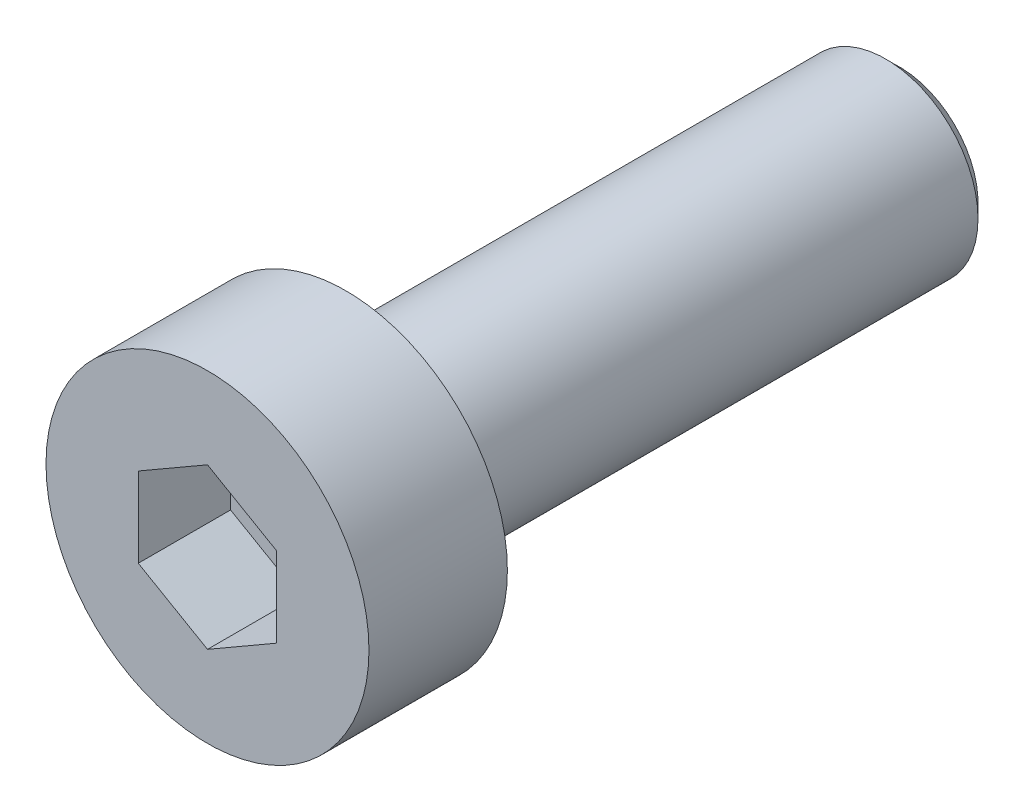
ISO-10303-21;
HEADER;
FILE_DESCRIPTION(('STEP AP214'),'2;1');
FILE_NAME('part.step','',(''),(''),'','','');
FILE_SCHEMA(('AUTOMOTIVE_DESIGN { 1 0 10303 214 1 1 1 1 }'));
ENDSEC;
DATA;
#1=APPLICATION_CONTEXT('core data for automotive mechanical design processes');
#2=APPLICATION_PROTOCOL_DEFINITION('international standard','automotive_design',2000,#1);
#3=PRODUCT_CONTEXT('',#1,'mechanical');
#4=PRODUCT('Part','Part','',(#3));
#5=PRODUCT_RELATED_PRODUCT_CATEGORY('part','',(#4));
#6=PRODUCT_DEFINITION_FORMATION('','',#4);
#7=PRODUCT_DEFINITION_CONTEXT('part definition',#1,'design');
#8=PRODUCT_DEFINITION('design','',#6,#7);
#9=PRODUCT_DEFINITION_SHAPE('','',#8);
#10=(LENGTH_UNIT() NAMED_UNIT(*) SI_UNIT(.MILLI.,.METRE.));
#11=(NAMED_UNIT(*) PLANE_ANGLE_UNIT() SI_UNIT($,.RADIAN.));
#12=(NAMED_UNIT(*) SI_UNIT($,.STERADIAN.) SOLID_ANGLE_UNIT());
#13=UNCERTAINTY_MEASURE_WITH_UNIT(LENGTH_MEASURE(1.E-05),#10,'distance_accuracy_value','');
#14=(GEOMETRIC_REPRESENTATION_CONTEXT(3) GLOBAL_UNCERTAINTY_ASSIGNED_CONTEXT((#13)) GLOBAL_UNIT_ASSIGNED_CONTEXT((#10,
#11,#12)) REPRESENTATION_CONTEXT('',''));
#15=CARTESIAN_POINT('',(0.,0.,0.));
#16=DIRECTION('',(0.,0.,1.));
#17=DIRECTION('',(1.,0.,0.));
#18=AXIS2_PLACEMENT_3D('',#15,#16,#17);
#19=CARTESIAN_POINT('',(0.,0.,0.));
#20=DIRECTION('',(0.,0.,1.));
#21=DIRECTION('',(1.,0.,0.));
#22=AXIS2_PLACEMENT_3D('',#19,#20,#21);
#23=PLANE('',#22);
#24=CARTESIAN_POINT('',(0.,0.,0.));
#25=DIRECTION('',(0.,0.,1.));
#26=DIRECTION('',(1.,0.,0.));
#27=AXIS2_PLACEMENT_3D('',#24,#25,#26);
#28=CIRCLE('',#27,3.5);
#29=CARTESIAN_POINT('',(3.5,0.,0.));
#30=VERTEX_POINT('',#29);
#31=EDGE_CURVE('E135',#30,#30,#28,.T.);
#32=ORIENTED_EDGE('',*,*,#31,.F.);
#33=EDGE_LOOP('',(#32));
#34=FACE_BOUND('',#33,.T.);
#35=CARTESIAN_POINT('',(0.,0.,0.));
#36=DIRECTION('',(0.,0.,1.));
#37=DIRECTION('',(1.,0.,0.));
#38=AXIS2_PLACEMENT_3D('',#35,#36,#37);
#39=CIRCLE('',#38,2.);
#40=CARTESIAN_POINT('',(2.,0.,0.));
#41=VERTEX_POINT('',#40);
#42=EDGE_CURVE('E144',#41,#41,#39,.F.);
#43=ORIENTED_EDGE('',*,*,#42,.F.);
#44=EDGE_LOOP('',(#43));
#45=FACE_BOUND('',#44,.T.);
#46=ADVANCED_FACE('F33',(#34,#45),#23,.F.);
#47=CARTESIAN_POINT('',(0.,0.,3.));
#48=DIRECTION('',(0.,0.,-1.));
#49=DIRECTION('',(-1.,0.,0.));
#50=AXIS2_PLACEMENT_3D('',#47,#48,#49);
#51=CYLINDRICAL_SURFACE('',#50,3.5);
#52=CARTESIAN_POINT('',(0.,0.,3.));
#53=DIRECTION('',(0.,0.,1.));
#54=DIRECTION('',(1.,0.,0.));
#55=AXIS2_PLACEMENT_3D('',#52,#53,#54);
#56=CIRCLE('',#55,3.5);
#57=CARTESIAN_POINT('',(3.5,0.,3.));
#58=VERTEX_POINT('',#57);
#59=EDGE_CURVE('E141',#58,#58,#56,.T.);
#60=ORIENTED_EDGE('',*,*,#59,.F.);
#61=EDGE_LOOP('',(#60));
#62=FACE_BOUND('',#61,.T.);
#63=ORIENTED_EDGE('',*,*,#31,.T.);
#64=EDGE_LOOP('',(#63));
#65=FACE_BOUND('',#64,.T.);
#66=ADVANCED_FACE('F166',(#62,#65),#51,.T.);
#67=CARTESIAN_POINT('',(0.,0.,3.));
#68=DIRECTION('',(0.,0.,1.));
#69=DIRECTION('',(1.,0.,0.));
#70=AXIS2_PLACEMENT_3D('',#67,#68,#69);
#71=PLANE('',#70);
#72=DIRECTION('',(-0.866025403784439,0.5,0.));
#73=VECTOR('',#72,1.);
#74=CARTESIAN_POINT('',(1.5,0.866025403784439,3.));
#75=LINE('',#74,#73);
#76=CARTESIAN_POINT('',(1.5,0.866025403784439,3.));
#77=VERTEX_POINT('',#76);
#78=CARTESIAN_POINT('',(0.,1.73205080756888,3.));
#79=VERTEX_POINT('',#78);
#80=EDGE_CURVE('E48',#77,#79,#75,.T.);
#81=ORIENTED_EDGE('',*,*,#80,.F.);
#82=DIRECTION('',(0.,1.,0.));
#83=VECTOR('',#82,1.);
#84=CARTESIAN_POINT('',(1.5,-0.866025403784439,3.));
#85=LINE('',#84,#83);
#86=CARTESIAN_POINT('',(1.5,-0.866025403784439,3.));
#87=VERTEX_POINT('',#86);
#88=EDGE_CURVE('E131',#87,#77,#85,.T.);
#89=ORIENTED_EDGE('',*,*,#88,.F.);
#90=DIRECTION('',(0.866025403784439,0.5,0.));
#91=VECTOR('',#90,1.);
#92=CARTESIAN_POINT('',(0.,-1.73205080756888,3.));
#93=LINE('',#92,#91);
#94=CARTESIAN_POINT('',(0.,-1.73205080756888,3.));
#95=VERTEX_POINT('',#94);
#96=EDGE_CURVE('E129',#95,#87,#93,.T.);
#97=ORIENTED_EDGE('',*,*,#96,.F.);
#98=DIRECTION('',(0.866025403784439,-0.5,0.));
#99=VECTOR('',#98,1.);
#100=CARTESIAN_POINT('',(-1.5,-0.866025403784439,3.));
#101=LINE('',#100,#99);
#102=CARTESIAN_POINT('',(-1.5,-0.866025403784439,3.));
#103=VERTEX_POINT('',#102);
#104=EDGE_CURVE('E96',#103,#95,#101,.T.);
#105=ORIENTED_EDGE('',*,*,#104,.F.);
#106=DIRECTION('',(0.,-1.,0.));
#107=VECTOR('',#106,1.);
#108=CARTESIAN_POINT('',(-1.5,0.866025403784439,3.));
#109=LINE('',#108,#107);
#110=CARTESIAN_POINT('',(-1.5,0.866025403784439,3.));
#111=VERTEX_POINT('',#110);
#112=EDGE_CURVE('E125',#111,#103,#109,.T.);
#113=ORIENTED_EDGE('',*,*,#112,.F.);
#114=DIRECTION('',(-0.866025403784439,-0.5,0.));
#115=VECTOR('',#114,1.);
#116=CARTESIAN_POINT('',(0.,1.73205080756888,3.));
#117=LINE('',#116,#115);
#118=EDGE_CURVE('E122',#79,#111,#117,.T.);
#119=ORIENTED_EDGE('',*,*,#118,.F.);
#120=EDGE_LOOP('',(#81,#89,#97,#105,#113,#119));
#121=FACE_BOUND('',#120,.T.);
#122=ORIENTED_EDGE('',*,*,#59,.T.);
#123=EDGE_LOOP('',(#122));
#124=FACE_BOUND('',#123,.T.);
#125=ADVANCED_FACE('F172',(#121,#124),#71,.T.);
#126=CARTESIAN_POINT('',(0.,0.,-12.));
#127=DIRECTION('',(0.,0.,1.));
#128=DIRECTION('',(1.,0.,0.));
#129=AXIS2_PLACEMENT_3D('',#126,#127,#128);
#130=CYLINDRICAL_SURFACE('',#129,2.);
#131=CARTESIAN_POINT('',(0.,0.,-11.7));
#132=DIRECTION('',(0.,0.,-1.));
#133=DIRECTION('',(-1.,0.,0.));
#134=AXIS2_PLACEMENT_3D('',#131,#132,#133);
#135=CIRCLE('',#134,2.);
#136=CARTESIAN_POINT('',(-2.,0.,-11.7));
#137=VERTEX_POINT('',#136);
#138=EDGE_CURVE('E11',#137,#137,#135,.F.);
#139=ORIENTED_EDGE('',*,*,#138,.T.);
#140=EDGE_LOOP('',(#139));
#141=FACE_BOUND('',#140,.T.);
#142=ORIENTED_EDGE('',*,*,#42,.T.);
#143=EDGE_LOOP('',(#142));
#144=FACE_BOUND('',#143,.T.);
#145=ADVANCED_FACE('F162',(#141,#144),#130,.T.);
#146=CARTESIAN_POINT('',(0.,0.,-12.));
#147=DIRECTION('',(0.,0.,-1.));
#148=DIRECTION('',(-1.,0.,0.));
#149=AXIS2_PLACEMENT_3D('',#146,#147,#148);
#150=PLANE('',#149);
#151=CARTESIAN_POINT('',(0.,0.,-12.));
#152=DIRECTION('',(0.,0.,-1.));
#153=DIRECTION('',(-1.,0.,0.));
#154=AXIS2_PLACEMENT_3D('',#151,#152,#153);
#155=CIRCLE('',#154,1.7);
#156=CARTESIAN_POINT('',(-1.7,0.,-12.));
#157=VERTEX_POINT('',#156);
#158=EDGE_CURVE('E41',#157,#157,#155,.T.);
#159=ORIENTED_EDGE('',*,*,#158,.T.);
#160=EDGE_LOOP('',(#159));
#161=FACE_BOUND('',#160,.T.);
#162=ADVANCED_FACE('F151',(#161),#150,.T.);
#163=CARTESIAN_POINT('',(0.,0.,-12.));
#164=DIRECTION('',(0.,0.,1.));
#165=DIRECTION('',(1.,0.,0.));
#166=AXIS2_PLACEMENT_3D('',#163,#164,#165);
#167=CONICAL_SURFACE('',#166,1.7,0.785398163397446);
#168=ORIENTED_EDGE('',*,*,#138,.F.);
#169=EDGE_LOOP('',(#168));
#170=FACE_BOUND('',#169,.T.);
#171=ORIENTED_EDGE('',*,*,#158,.F.);
#172=EDGE_LOOP('',(#171));
#173=FACE_BOUND('',#172,.T.);
#174=ADVANCED_FACE('F35',(#170,#173),#167,.T.);
#175=CARTESIAN_POINT('',(1.5,0.866025403784439,1.));
#176=DIRECTION('',(0.5,0.866025403784439,0.));
#177=DIRECTION('',(-0.866025403784439,0.5,0.));
#178=AXIS2_PLACEMENT_3D('',#175,#176,#177);
#179=PLANE('',#178);
#180=ORIENTED_EDGE('',*,*,#80,.T.);
#181=DIRECTION('',(0.,0.,1.));
#182=VECTOR('',#181,1.);
#183=CARTESIAN_POINT('',(0.,1.73205080756888,1.));
#184=LINE('',#183,#182);
#185=CARTESIAN_POINT('',(0.,1.73205080756888,1.));
#186=VERTEX_POINT('',#185);
#187=EDGE_CURVE('E78',#186,#79,#184,.T.);
#188=ORIENTED_EDGE('',*,*,#187,.F.);
#189=DIRECTION('',(-0.866025403784439,0.5,0.));
#190=VECTOR('',#189,1.);
#191=CARTESIAN_POINT('',(1.5,0.866025403784439,1.));
#192=LINE('',#191,#190);
#193=CARTESIAN_POINT('',(1.5,0.866025403784439,1.));
#194=VERTEX_POINT('',#193);
#195=EDGE_CURVE('E133',#194,#186,#192,.T.);
#196=ORIENTED_EDGE('',*,*,#195,.F.);
#197=DIRECTION('',(0.,0.,1.));
#198=VECTOR('',#197,1.);
#199=CARTESIAN_POINT('',(1.5,0.866025403784439,1.));
#200=LINE('',#199,#198);
#201=EDGE_CURVE('E56',#194,#77,#200,.T.);
#202=ORIENTED_EDGE('',*,*,#201,.T.);
#203=EDGE_LOOP('',(#180,#188,#196,#202));
#204=FACE_BOUND('',#203,.T.);
#205=ADVANCED_FACE('F154',(#204),#179,.F.);
#206=CARTESIAN_POINT('',(1.5,-0.866025403784439,1.));
#207=DIRECTION('',(1.,0.,0.));
#208=DIRECTION('',(0.,1.,0.));
#209=AXIS2_PLACEMENT_3D('',#206,#207,#208);
#210=PLANE('',#209);
#211=ORIENTED_EDGE('',*,*,#88,.T.);
#212=ORIENTED_EDGE('',*,*,#201,.F.);
#213=DIRECTION('',(0.,1.,0.));
#214=VECTOR('',#213,1.);
#215=CARTESIAN_POINT('',(1.5,-0.866025403784439,1.));
#216=LINE('',#215,#214);
#217=CARTESIAN_POINT('',(1.5,-0.866025403784439,1.));
#218=VERTEX_POINT('',#217);
#219=EDGE_CURVE('E108',#218,#194,#216,.T.);
#220=ORIENTED_EDGE('',*,*,#219,.F.);
#221=DIRECTION('',(0.,0.,1.));
#222=VECTOR('',#221,1.);
#223=CARTESIAN_POINT('',(1.5,-0.866025403784439,1.));
#224=LINE('',#223,#222);
#225=EDGE_CURVE('E100',#218,#87,#224,.T.);
#226=ORIENTED_EDGE('',*,*,#225,.T.);
#227=EDGE_LOOP('',(#211,#212,#220,#226));
#228=FACE_BOUND('',#227,.T.);
#229=ADVANCED_FACE('F160',(#228),#210,.F.);
#230=CARTESIAN_POINT('',(0.,-1.73205080756888,1.));
#231=DIRECTION('',(0.5,-0.866025403784439,0.));
#232=DIRECTION('',(0.866025403784439,0.5,0.));
#233=AXIS2_PLACEMENT_3D('',#230,#231,#232);
#234=PLANE('',#233);
#235=ORIENTED_EDGE('',*,*,#96,.T.);
#236=ORIENTED_EDGE('',*,*,#225,.F.);
#237=DIRECTION('',(0.866025403784439,0.5,0.));
#238=VECTOR('',#237,1.);
#239=CARTESIAN_POINT('',(0.,-1.73205080756888,1.));
#240=LINE('',#239,#238);
#241=CARTESIAN_POINT('',(0.,-1.73205080756888,1.));
#242=VERTEX_POINT('',#241);
#243=EDGE_CURVE('E104',#242,#218,#240,.T.);
#244=ORIENTED_EDGE('',*,*,#243,.F.);
#245=DIRECTION('',(0.,0.,1.));
#246=VECTOR('',#245,1.);
#247=CARTESIAN_POINT('',(0.,-1.73205080756888,1.));
#248=LINE('',#247,#246);
#249=EDGE_CURVE('E89',#242,#95,#248,.T.);
#250=ORIENTED_EDGE('',*,*,#249,.T.);
#251=EDGE_LOOP('',(#235,#236,#244,#250));
#252=FACE_BOUND('',#251,.T.);
#253=ADVANCED_FACE('F105',(#252),#234,.F.);
#254=CARTESIAN_POINT('',(-1.5,-0.866025403784439,1.));
#255=DIRECTION('',(-0.5,-0.866025403784439,0.));
#256=DIRECTION('',(0.866025403784439,-0.5,0.));
#257=AXIS2_PLACEMENT_3D('',#254,#255,#256);
#258=PLANE('',#257);
#259=ORIENTED_EDGE('',*,*,#104,.T.);
#260=ORIENTED_EDGE('',*,*,#249,.F.);
#261=DIRECTION('',(0.866025403784439,-0.5,0.));
#262=VECTOR('',#261,1.);
#263=CARTESIAN_POINT('',(-1.5,-0.866025403784439,1.));
#264=LINE('',#263,#262);
#265=CARTESIAN_POINT('',(-1.5,-0.866025403784439,1.));
#266=VERTEX_POINT('',#265);
#267=EDGE_CURVE('E93',#266,#242,#264,.T.);
#268=ORIENTED_EDGE('',*,*,#267,.F.);
#269=DIRECTION('',(0.,0.,1.));
#270=VECTOR('',#269,1.);
#271=CARTESIAN_POINT('',(-1.5,-0.866025403784439,1.));
#272=LINE('',#271,#270);
#273=EDGE_CURVE('E101',#266,#103,#272,.T.);
#274=ORIENTED_EDGE('',*,*,#273,.T.);
#275=EDGE_LOOP('',(#259,#260,#268,#274));
#276=FACE_BOUND('',#275,.T.);
#277=ADVANCED_FACE('F91',(#276),#258,.F.);
#278=CARTESIAN_POINT('',(-1.5,0.866025403784439,1.));
#279=DIRECTION('',(-1.,0.,0.));
#280=DIRECTION('',(0.,0.,1.));
#281=AXIS2_PLACEMENT_3D('',#278,#279,#280);
#282=PLANE('',#281);
#283=ORIENTED_EDGE('',*,*,#112,.T.);
#284=ORIENTED_EDGE('',*,*,#273,.F.);
#285=DIRECTION('',(0.,-1.,0.));
#286=VECTOR('',#285,1.);
#287=CARTESIAN_POINT('',(-1.5,0.866025403784439,1.));
#288=LINE('',#287,#286);
#289=CARTESIAN_POINT('',(-1.5,0.866025403784439,1.));
#290=VERTEX_POINT('',#289);
#291=EDGE_CURVE('E114',#290,#266,#288,.T.);
#292=ORIENTED_EDGE('',*,*,#291,.F.);
#293=DIRECTION('',(0.,0.,1.));
#294=VECTOR('',#293,1.);
#295=CARTESIAN_POINT('',(-1.5,0.866025403784439,1.));
#296=LINE('',#295,#294);
#297=EDGE_CURVE('E138',#290,#111,#296,.T.);
#298=ORIENTED_EDGE('',*,*,#297,.T.);
#299=EDGE_LOOP('',(#283,#284,#292,#298));
#300=FACE_BOUND('',#299,.T.);
#301=ADVANCED_FACE('F186',(#300),#282,.F.);
#302=CARTESIAN_POINT('',(0.,1.73205080756888,1.));
#303=DIRECTION('',(-0.5,0.866025403784439,0.));
#304=DIRECTION('',(-0.866025403784439,-0.5,0.));
#305=AXIS2_PLACEMENT_3D('',#302,#303,#304);
#306=PLANE('',#305);
#307=ORIENTED_EDGE('',*,*,#118,.T.);
#308=ORIENTED_EDGE('',*,*,#297,.F.);
#309=DIRECTION('',(-0.866025403784439,-0.5,0.));
#310=VECTOR('',#309,1.);
#311=CARTESIAN_POINT('',(0.,1.73205080756888,1.));
#312=LINE('',#311,#310);
#313=EDGE_CURVE('E116',#186,#290,#312,.T.);
#314=ORIENTED_EDGE('',*,*,#313,.F.);
#315=ORIENTED_EDGE('',*,*,#187,.T.);
#316=EDGE_LOOP('',(#307,#308,#314,#315));
#317=FACE_BOUND('',#316,.T.);
#318=ADVANCED_FACE('F183',(#317),#306,.F.);
#319=CARTESIAN_POINT('',(0.,0.,1.));
#320=DIRECTION('',(0.,0.,1.));
#321=DIRECTION('',(1.,0.,0.));
#322=AXIS2_PLACEMENT_3D('',#319,#320,#321);
#323=PLANE('',#322);
#324=ORIENTED_EDGE('',*,*,#195,.T.);
#325=ORIENTED_EDGE('',*,*,#313,.T.);
#326=ORIENTED_EDGE('',*,*,#291,.T.);
#327=ORIENTED_EDGE('',*,*,#267,.T.);
#328=ORIENTED_EDGE('',*,*,#243,.T.);
#329=ORIENTED_EDGE('',*,*,#219,.T.);
#330=EDGE_LOOP('',(#324,#325,#326,#327,#328,#329));
#331=FACE_BOUND('',#330,.T.);
#332=ADVANCED_FACE('F111',(#331),#323,.T.);
#333=CLOSED_SHELL('',(#46,#66,#125,#145,#162,#174,#205,#229,#253,#277,#301,#318,#332));
#334=MANIFOLD_SOLID_BREP('B2',#333);
#335=ADVANCED_BREP_SHAPE_REPRESENTATION('',(#18,#334),#14);
#336=SHAPE_DEFINITION_REPRESENTATION(#9,#335);
ENDSEC;
END-ISO-10303-21;
